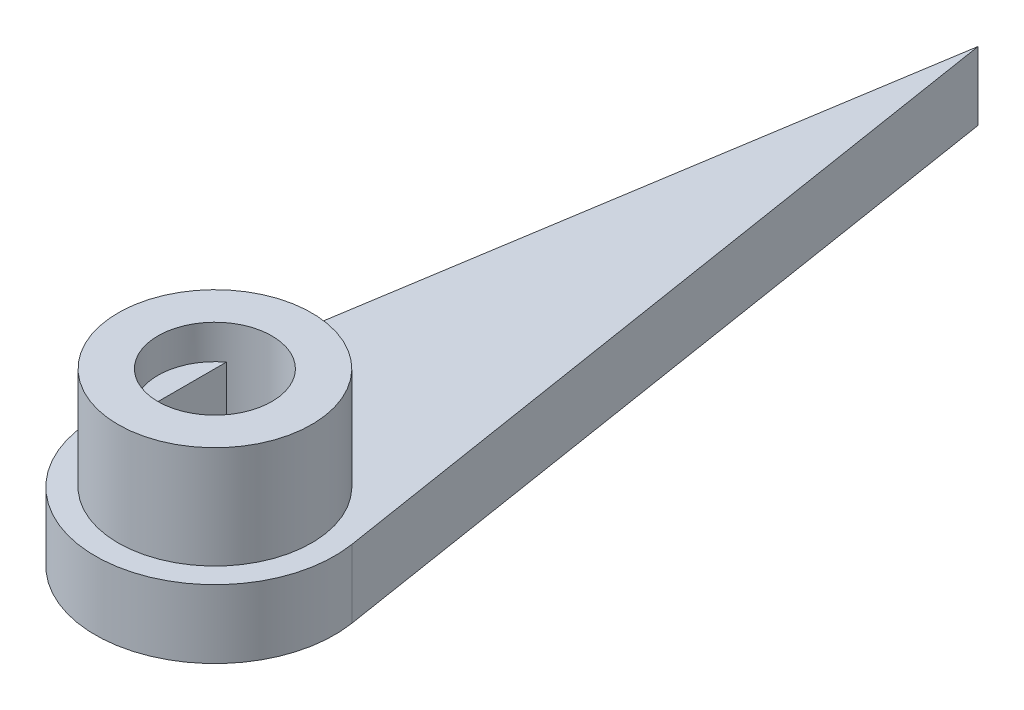
ISO-10303-21;
HEADER;
FILE_DESCRIPTION(('STEP AP214'),'2;1');
FILE_NAME('part.step','',(''),(''),'','','');
FILE_SCHEMA(('AUTOMOTIVE_DESIGN { 1 0 10303 214 1 1 1 1 }'));
ENDSEC;
DATA;
#1=APPLICATION_CONTEXT('core data for automotive mechanical design processes');
#2=APPLICATION_PROTOCOL_DEFINITION('international standard','automotive_design',2000,#1);
#3=PRODUCT_CONTEXT('',#1,'mechanical');
#4=PRODUCT('Part','Part','',(#3));
#5=PRODUCT_RELATED_PRODUCT_CATEGORY('part','',(#4));
#6=PRODUCT_DEFINITION_FORMATION('','',#4);
#7=PRODUCT_DEFINITION_CONTEXT('part definition',#1,'design');
#8=PRODUCT_DEFINITION('design','',#6,#7);
#9=PRODUCT_DEFINITION_SHAPE('','',#8);
#10=(LENGTH_UNIT() NAMED_UNIT(*) SI_UNIT(.MILLI.,.METRE.));
#11=(NAMED_UNIT(*) PLANE_ANGLE_UNIT() SI_UNIT($,.RADIAN.));
#12=(NAMED_UNIT(*) SI_UNIT($,.STERADIAN.) SOLID_ANGLE_UNIT());
#13=UNCERTAINTY_MEASURE_WITH_UNIT(LENGTH_MEASURE(1.E-05),#10,'distance_accuracy_value','');
#14=(GEOMETRIC_REPRESENTATION_CONTEXT(3) GLOBAL_UNCERTAINTY_ASSIGNED_CONTEXT((#13)) GLOBAL_UNIT_ASSIGNED_CONTEXT((#10,
#11,#12)) REPRESENTATION_CONTEXT('',''));
#15=CARTESIAN_POINT('',(0.,0.,0.));
#16=DIRECTION('',(0.,0.,1.));
#17=DIRECTION('',(1.,0.,0.));
#18=AXIS2_PLACEMENT_3D('',#15,#16,#17);
#19=CARTESIAN_POINT('',(0.,6.,0.));
#20=DIRECTION('',(0.,1.,0.));
#21=DIRECTION('',(0.,0.,1.));
#22=AXIS2_PLACEMENT_3D('',#19,#20,#21);
#23=PLANE('',#22);
#24=DIRECTION('',(0.,0.,-1.));
#25=VECTOR('',#24,1.);
#26=CARTESIAN_POINT('',(1.5,6.,-2.));
#27=LINE('',#26,#25);
#28=CARTESIAN_POINT('',(1.5,6.,2.));
#29=VERTEX_POINT('',#28);
#30=CARTESIAN_POINT('',(1.5,6.,-2.));
#31=VERTEX_POINT('',#30);
#32=EDGE_CURVE('E132',#29,#31,#27,.T.);
#33=ORIENTED_EDGE('',*,*,#32,.F.);
#34=CARTESIAN_POINT('',(0.,6.,0.));
#35=DIRECTION('',(0.,1.,0.));
#36=DIRECTION('',(0.,0.,1.));
#37=AXIS2_PLACEMENT_3D('',#34,#35,#36);
#38=CIRCLE('',#37,2.5);
#39=EDGE_CURVE('E43',#29,#31,#38,.T.);
#40=ORIENTED_EDGE('',*,*,#39,.T.);
#41=EDGE_LOOP('',(#33,#40));
#42=FACE_BOUND('',#41,.T.);
#43=ADVANCED_FACE('F35',(#42),#23,.T.);
#44=CARTESIAN_POINT('',(0.,7.5,0.));
#45=DIRECTION('',(0.,-1.,0.));
#46=DIRECTION('',(0.,0.,-1.));
#47=AXIS2_PLACEMENT_3D('',#44,#45,#46);
#48=CYLINDRICAL_SURFACE('',#47,4.25);
#49=CARTESIAN_POINT('',(0.,3.,0.));
#50=DIRECTION('',(0.,1.,0.));
#51=DIRECTION('',(0.,0.,1.));
#52=AXIS2_PLACEMENT_3D('',#49,#50,#51);
#53=CIRCLE('',#52,4.25);
#54=CARTESIAN_POINT('',(0.,3.,4.25));
#55=VERTEX_POINT('',#54);
#56=EDGE_CURVE('E106',#55,#55,#53,.T.);
#57=ORIENTED_EDGE('',*,*,#56,.T.);
#58=EDGE_LOOP('',(#57));
#59=FACE_BOUND('',#58,.T.);
#60=CARTESIAN_POINT('',(0.,7.5,0.));
#61=DIRECTION('',(0.,1.,0.));
#62=DIRECTION('',(0.,0.,1.));
#63=AXIS2_PLACEMENT_3D('',#60,#61,#62);
#64=CIRCLE('',#63,4.25);
#65=CARTESIAN_POINT('',(0.,7.5,4.25));
#66=VERTEX_POINT('',#65);
#67=EDGE_CURVE('E11',#66,#66,#64,.T.);
#68=ORIENTED_EDGE('',*,*,#67,.F.);
#69=EDGE_LOOP('',(#68));
#70=FACE_BOUND('',#69,.T.);
#71=ADVANCED_FACE('F37',(#59,#70),#48,.T.);
#72=CARTESIAN_POINT('',(0.,7.5,0.));
#73=DIRECTION('',(0.,1.,0.));
#74=DIRECTION('',(0.,0.,1.));
#75=AXIS2_PLACEMENT_3D('',#72,#73,#74);
#76=PLANE('',#75);
#77=CARTESIAN_POINT('',(0.,7.5,0.));
#78=DIRECTION('',(0.,1.,0.));
#79=DIRECTION('',(0.,0.,1.));
#80=AXIS2_PLACEMENT_3D('',#77,#78,#79);
#81=CIRCLE('',#80,2.5);
#82=CARTESIAN_POINT('',(0.,7.5,2.5));
#83=VERTEX_POINT('',#82);
#84=EDGE_CURVE('E150',#83,#83,#81,.T.);
#85=ORIENTED_EDGE('',*,*,#84,.F.);
#86=EDGE_LOOP('',(#85));
#87=FACE_BOUND('',#86,.T.);
#88=ORIENTED_EDGE('',*,*,#67,.T.);
#89=EDGE_LOOP('',(#88));
#90=FACE_BOUND('',#89,.T.);
#91=ADVANCED_FACE('F183',(#87,#90),#76,.T.);
#92=CARTESIAN_POINT('',(0.,0.,0.));
#93=DIRECTION('',(0.,1.,0.));
#94=DIRECTION('',(0.,0.,1.));
#95=AXIS2_PLACEMENT_3D('',#92,#93,#94);
#96=PLANE('',#95);
#97=DIRECTION('',(0.,0.,1.));
#98=VECTOR('',#97,1.);
#99=CARTESIAN_POINT('',(-1.5,0.,2.));
#100=LINE('',#99,#98);
#101=CARTESIAN_POINT('',(-1.5,0.,-2.));
#102=VERTEX_POINT('',#101);
#103=CARTESIAN_POINT('',(-1.5,0.,2.));
#104=VERTEX_POINT('',#103);
#105=EDGE_CURVE('E141',#102,#104,#100,.T.);
#106=ORIENTED_EDGE('',*,*,#105,.T.);
#107=CARTESIAN_POINT('',(0.,0.,0.));
#108=DIRECTION('',(0.,1.,0.));
#109=DIRECTION('',(0.,0.,1.));
#110=AXIS2_PLACEMENT_3D('',#107,#108,#109);
#111=CIRCLE('',#110,2.5);
#112=CARTESIAN_POINT('',(1.5,0.,2.));
#113=VERTEX_POINT('',#112);
#114=EDGE_CURVE('E133',#104,#113,#111,.T.);
#115=ORIENTED_EDGE('',*,*,#114,.T.);
#116=DIRECTION('',(0.,0.,-1.));
#117=VECTOR('',#116,1.);
#118=CARTESIAN_POINT('',(1.5,0.,-2.));
#119=LINE('',#118,#117);
#120=CARTESIAN_POINT('',(1.5,0.,-2.));
#121=VERTEX_POINT('',#120);
#122=EDGE_CURVE('E136',#113,#121,#119,.T.);
#123=ORIENTED_EDGE('',*,*,#122,.T.);
#124=CARTESIAN_POINT('',(0.,0.,0.));
#125=DIRECTION('',(0.,1.,0.));
#126=DIRECTION('',(0.,0.,1.));
#127=AXIS2_PLACEMENT_3D('',#124,#125,#126);
#128=CIRCLE('',#127,2.5);
#129=EDGE_CURVE('E57',#121,#102,#128,.T.);
#130=ORIENTED_EDGE('',*,*,#129,.T.);
#131=EDGE_LOOP('',(#106,#115,#123,#130));
#132=FACE_BOUND('',#131,.T.);
#133=DIRECTION('',(0.156716417910176,0.,-0.987643642392034));
#134=VECTOR('',#133,1.);
#135=CARTESIAN_POINT('',(-5.18512912255818,0.,-0.822761194028426));
#136=LINE('',#135,#134);
#137=CARTESIAN_POINT('',(-5.18512912255818,0.,-0.822761194028426));
#138=VERTEX_POINT('',#137);
#139=CARTESIAN_POINT('',(-9.20184067831897E-12,0.,-33.5));
#140=VERTEX_POINT('',#139);
#141=EDGE_CURVE('E102',#138,#140,#136,.T.);
#142=ORIENTED_EDGE('',*,*,#141,.T.);
#143=DIRECTION('',(0.156716417910719,0.,0.987643642391948));
#144=VECTOR('',#143,1.);
#145=CARTESIAN_POINT('',(5.18512912255772,0.,-0.822761194031274));
#146=LINE('',#145,#144);
#147=CARTESIAN_POINT('',(5.18512912255772,0.,-0.822761194031275));
#148=VERTEX_POINT('',#147);
#149=EDGE_CURVE('E118',#140,#148,#146,.T.);
#150=ORIENTED_EDGE('',*,*,#149,.T.);
#151=CARTESIAN_POINT('',(0.,0.,0.));
#152=DIRECTION('',(0.,1.,0.));
#153=DIRECTION('',(0.,0.,1.));
#154=AXIS2_PLACEMENT_3D('',#151,#152,#153);
#155=CIRCLE('',#154,5.25);
#156=EDGE_CURVE('E121',#138,#148,#155,.T.);
#157=ORIENTED_EDGE('',*,*,#156,.F.);
#158=EDGE_LOOP('',(#142,#150,#157));
#159=FACE_BOUND('',#158,.T.);
#160=ADVANCED_FACE('F189',(#132,#159),#96,.F.);
#161=CARTESIAN_POINT('',(0.,6.,0.));
#162=DIRECTION('',(0.,1.,0.));
#163=DIRECTION('',(0.,0.,1.));
#164=AXIS2_PLACEMENT_3D('',#161,#162,#163);
#165=CYLINDRICAL_SURFACE('',#164,2.5);
#166=CARTESIAN_POINT('',(-1.5,6.,-2.));
#167=VERTEX_POINT('',#166);
#168=CARTESIAN_POINT('',(-1.5,6.,2.));
#169=VERTEX_POINT('',#168);
#170=EDGE_CURVE('E156',#167,#169,#38,.T.);
#171=ORIENTED_EDGE('',*,*,#170,.F.);
#172=DIRECTION('',(0.,1.,0.));
#173=VECTOR('',#172,1.);
#174=CARTESIAN_POINT('',(-1.5,0.,-2.));
#175=LINE('',#174,#173);
#176=EDGE_CURVE('E50',#102,#167,#175,.T.);
#177=ORIENTED_EDGE('',*,*,#176,.F.);
#178=ORIENTED_EDGE('',*,*,#129,.F.);
#179=DIRECTION('',(0.,1.,0.));
#180=VECTOR('',#179,1.);
#181=CARTESIAN_POINT('',(1.5,0.,-2.));
#182=LINE('',#181,#180);
#183=EDGE_CURVE('E152',#121,#31,#182,.T.);
#184=ORIENTED_EDGE('',*,*,#183,.T.);
#185=ORIENTED_EDGE('',*,*,#39,.F.);
#186=DIRECTION('',(0.,1.,0.));
#187=VECTOR('',#186,1.);
#188=CARTESIAN_POINT('',(1.5,0.,2.));
#189=LINE('',#188,#187);
#190=EDGE_CURVE('E144',#113,#29,#189,.T.);
#191=ORIENTED_EDGE('',*,*,#190,.F.);
#192=ORIENTED_EDGE('',*,*,#114,.F.);
#193=DIRECTION('',(0.,1.,0.));
#194=VECTOR('',#193,1.);
#195=CARTESIAN_POINT('',(-1.5,0.,2.));
#196=LINE('',#195,#194);
#197=EDGE_CURVE('E148',#104,#169,#196,.T.);
#198=ORIENTED_EDGE('',*,*,#197,.T.);
#199=EDGE_LOOP('',(#171,#177,#178,#184,#185,#191,#192,#198));
#200=FACE_BOUND('',#199,.T.);
#201=ORIENTED_EDGE('',*,*,#84,.T.);
#202=EDGE_LOOP('',(#201));
#203=FACE_BOUND('',#202,.T.);
#204=ADVANCED_FACE('F164',(#200,#203),#165,.F.);
#205=DIRECTION('',(0.,0.,1.));
#206=VECTOR('',#205,1.);
#207=CARTESIAN_POINT('',(-1.5,6.,2.));
#208=LINE('',#207,#206);
#209=EDGE_CURVE('E137',#167,#169,#208,.T.);
#210=ORIENTED_EDGE('',*,*,#209,.F.);
#211=ORIENTED_EDGE('',*,*,#170,.T.);
#212=EDGE_LOOP('',(#210,#211));
#213=FACE_BOUND('',#212,.T.);
#214=ADVANCED_FACE('F163',(#213),#23,.T.);
#215=CARTESIAN_POINT('',(-1.5,0.,2.));
#216=DIRECTION('',(-1.,0.,0.));
#217=DIRECTION('',(0.,0.,1.));
#218=AXIS2_PLACEMENT_3D('',#215,#216,#217);
#219=PLANE('',#218);
#220=ORIENTED_EDGE('',*,*,#209,.T.);
#221=ORIENTED_EDGE('',*,*,#197,.F.);
#222=ORIENTED_EDGE('',*,*,#105,.F.);
#223=ORIENTED_EDGE('',*,*,#176,.T.);
#224=EDGE_LOOP('',(#220,#221,#222,#223));
#225=FACE_BOUND('',#224,.T.);
#226=ADVANCED_FACE('F166',(#225),#219,.F.);
#227=CARTESIAN_POINT('',(1.5,0.,-2.));
#228=DIRECTION('',(1.,0.,0.));
#229=DIRECTION('',(0.,0.,-1.));
#230=AXIS2_PLACEMENT_3D('',#227,#228,#229);
#231=PLANE('',#230);
#232=ORIENTED_EDGE('',*,*,#32,.T.);
#233=ORIENTED_EDGE('',*,*,#183,.F.);
#234=ORIENTED_EDGE('',*,*,#122,.F.);
#235=ORIENTED_EDGE('',*,*,#190,.T.);
#236=EDGE_LOOP('',(#232,#233,#234,#235));
#237=FACE_BOUND('',#236,.T.);
#238=ADVANCED_FACE('F168',(#237),#231,.F.);
#239=CARTESIAN_POINT('',(0.,3.,0.));
#240=DIRECTION('',(0.,1.,0.));
#241=DIRECTION('',(0.,0.,1.));
#242=AXIS2_PLACEMENT_3D('',#239,#240,#241);
#243=PLANE('',#242);
#244=DIRECTION('',(0.156716417910176,0.,-0.987643642392034));
#245=VECTOR('',#244,1.);
#246=CARTESIAN_POINT('',(-5.18512912255818,3.,-0.822761194028426));
#247=LINE('',#246,#245);
#248=CARTESIAN_POINT('',(-5.18512912255818,3.,-0.822761194028426));
#249=VERTEX_POINT('',#248);
#250=CARTESIAN_POINT('',(-9.20184067831897E-12,3.,-33.5));
#251=VERTEX_POINT('',#250);
#252=EDGE_CURVE('E99',#249,#251,#247,.T.);
#253=ORIENTED_EDGE('',*,*,#252,.F.);
#254=CARTESIAN_POINT('',(0.,3.,0.));
#255=DIRECTION('',(0.,1.,0.));
#256=DIRECTION('',(0.,0.,1.));
#257=AXIS2_PLACEMENT_3D('',#254,#255,#256);
#258=CIRCLE('',#257,5.25);
#259=CARTESIAN_POINT('',(5.18512912255772,3.,-0.822761194031275));
#260=VERTEX_POINT('',#259);
#261=EDGE_CURVE('E110',#249,#260,#258,.T.);
#262=ORIENTED_EDGE('',*,*,#261,.T.);
#263=DIRECTION('',(0.156716417910719,0.,0.987643642391948));
#264=VECTOR('',#263,1.);
#265=CARTESIAN_POINT('',(5.18512912255772,3.,-0.822761194031274));
#266=LINE('',#265,#264);
#267=EDGE_CURVE('E114',#251,#260,#266,.T.);
#268=ORIENTED_EDGE('',*,*,#267,.F.);
#269=EDGE_LOOP('',(#253,#262,#268));
#270=FACE_BOUND('',#269,.T.);
#271=ORIENTED_EDGE('',*,*,#56,.F.);
#272=EDGE_LOOP('',(#271));
#273=FACE_BOUND('',#272,.T.);
#274=ADVANCED_FACE('F116',(#270,#273),#243,.T.);
#275=CARTESIAN_POINT('',(-5.18512912255818,3.,-0.822761194028426));
#276=DIRECTION('',(-0.987643642392034,0.,-0.156716417910176));
#277=DIRECTION('',(-0.156716417910176,0.,0.987643642392034));
#278=AXIS2_PLACEMENT_3D('',#275,#276,#277);
#279=PLANE('',#278);
#280=ORIENTED_EDGE('',*,*,#141,.F.);
#281=DIRECTION('',(0.,-1.,0.));
#282=VECTOR('',#281,1.);
#283=CARTESIAN_POINT('',(-5.18512912255818,3.,-0.822761194028426));
#284=LINE('',#283,#282);
#285=EDGE_CURVE('E95',#249,#138,#284,.T.);
#286=ORIENTED_EDGE('',*,*,#285,.F.);
#287=ORIENTED_EDGE('',*,*,#252,.T.);
#288=DIRECTION('',(0.,-1.,0.));
#289=VECTOR('',#288,1.);
#290=CARTESIAN_POINT('',(-9.20184067831897E-12,3.,-33.5));
#291=LINE('',#290,#289);
#292=EDGE_CURVE('E125',#251,#140,#291,.T.);
#293=ORIENTED_EDGE('',*,*,#292,.T.);
#294=EDGE_LOOP('',(#280,#286,#287,#293));
#295=FACE_BOUND('',#294,.T.);
#296=ADVANCED_FACE('F97',(#295),#279,.T.);
#297=CARTESIAN_POINT('',(0.,3.,0.));
#298=DIRECTION('',(0.,-1.,0.));
#299=DIRECTION('',(0.,0.,-1.));
#300=AXIS2_PLACEMENT_3D('',#297,#298,#299);
#301=CYLINDRICAL_SURFACE('',#300,5.25);
#302=ORIENTED_EDGE('',*,*,#156,.T.);
#303=DIRECTION('',(0.,-1.,0.));
#304=VECTOR('',#303,1.);
#305=CARTESIAN_POINT('',(5.18512912255772,3.,-0.822761194031275));
#306=LINE('',#305,#304);
#307=EDGE_CURVE('E107',#260,#148,#306,.T.);
#308=ORIENTED_EDGE('',*,*,#307,.F.);
#309=ORIENTED_EDGE('',*,*,#261,.F.);
#310=ORIENTED_EDGE('',*,*,#285,.T.);
#311=EDGE_LOOP('',(#302,#308,#309,#310));
#312=FACE_BOUND('',#311,.T.);
#313=ADVANCED_FACE('F111',(#312),#301,.T.);
#314=CARTESIAN_POINT('',(5.18512912255772,3.,-0.822761194031274));
#315=DIRECTION('',(0.987643642391947,0.,-0.156716417910719));
#316=DIRECTION('',(-0.156716417910719,0.,-0.987643642391947));
#317=AXIS2_PLACEMENT_3D('',#314,#315,#316);
#318=PLANE('',#317);
#319=ORIENTED_EDGE('',*,*,#149,.F.);
#320=ORIENTED_EDGE('',*,*,#292,.F.);
#321=ORIENTED_EDGE('',*,*,#267,.T.);
#322=ORIENTED_EDGE('',*,*,#307,.T.);
#323=EDGE_LOOP('',(#319,#320,#321,#322));
#324=FACE_BOUND('',#323,.T.);
#325=ADVANCED_FACE('F199',(#324),#318,.T.);
#326=CLOSED_SHELL('',(#43,#71,#91,#160,#204,#214,#226,#238,#274,#296,#313,#325));
#327=MANIFOLD_SOLID_BREP('B2',#326);
#328=ADVANCED_BREP_SHAPE_REPRESENTATION('',(#18,#327),#14);
#329=SHAPE_DEFINITION_REPRESENTATION(#9,#328);
ENDSEC;
END-ISO-10303-21;
